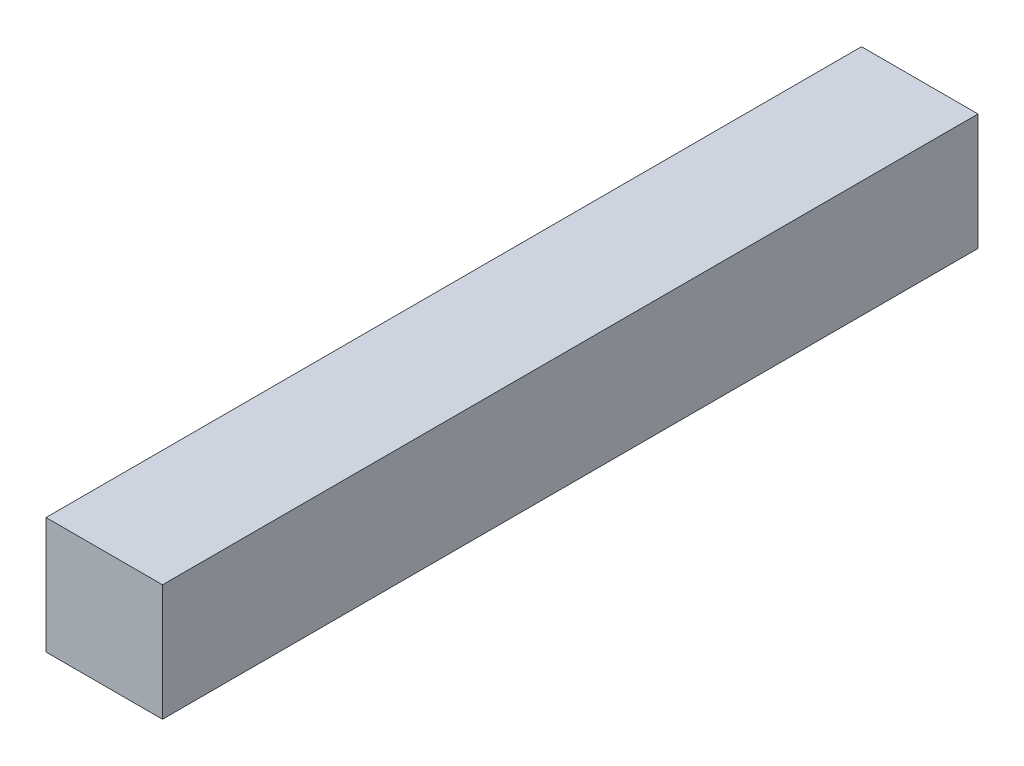
ISO-10303-21;
HEADER;
FILE_DESCRIPTION(('STEP AP214'),'2;1');
FILE_NAME('part.step','',(''),(''),'','','');
FILE_SCHEMA(('AUTOMOTIVE_DESIGN { 1 0 10303 214 1 1 1 1 }'));
ENDSEC;
DATA;
#1=APPLICATION_CONTEXT('core data for automotive mechanical design processes');
#2=APPLICATION_PROTOCOL_DEFINITION('international standard','automotive_design',2000,#1);
#3=PRODUCT_CONTEXT('',#1,'mechanical');
#4=PRODUCT('Part','Part','',(#3));
#5=PRODUCT_RELATED_PRODUCT_CATEGORY('part','',(#4));
#6=PRODUCT_DEFINITION_FORMATION('','',#4);
#7=PRODUCT_DEFINITION_CONTEXT('part definition',#1,'design');
#8=PRODUCT_DEFINITION('design','',#6,#7);
#9=PRODUCT_DEFINITION_SHAPE('','',#8);
#10=(LENGTH_UNIT() NAMED_UNIT(*) SI_UNIT(.MILLI.,.METRE.));
#11=(NAMED_UNIT(*) PLANE_ANGLE_UNIT() SI_UNIT($,.RADIAN.));
#12=(NAMED_UNIT(*) SI_UNIT($,.STERADIAN.) SOLID_ANGLE_UNIT());
#13=UNCERTAINTY_MEASURE_WITH_UNIT(LENGTH_MEASURE(1.E-05),#10,'distance_accuracy_value','');
#14=(GEOMETRIC_REPRESENTATION_CONTEXT(3) GLOBAL_UNCERTAINTY_ASSIGNED_CONTEXT((#13)) GLOBAL_UNIT_ASSIGNED_CONTEXT((#10,
#11,#12)) REPRESENTATION_CONTEXT('',''));
#15=CARTESIAN_POINT('',(0.,0.,0.));
#16=DIRECTION('',(0.,0.,1.));
#17=DIRECTION('',(1.,0.,0.));
#18=AXIS2_PLACEMENT_3D('',#15,#16,#17);
#19=CARTESIAN_POINT('',(-25.,-25.,350.));
#20=DIRECTION('',(1.,0.,0.));
#21=DIRECTION('',(0.,0.,-1.));
#22=AXIS2_PLACEMENT_3D('',#19,#20,#21);
#23=PLANE('',#22);
#24=DIRECTION('',(0.,-1.,0.));
#25=VECTOR('',#24,1.);
#26=CARTESIAN_POINT('',(-25.,-25.,0.));
#27=LINE('',#26,#25);
#28=CARTESIAN_POINT('',(-25.,25.,0.));
#29=VERTEX_POINT('',#28);
#30=CARTESIAN_POINT('',(-25.,-25.,0.));
#31=VERTEX_POINT('',#30);
#32=EDGE_CURVE('E111',#29,#31,#27,.T.);
#33=ORIENTED_EDGE('',*,*,#32,.T.);
#34=DIRECTION('',(0.,0.,-1.));
#35=VECTOR('',#34,1.);
#36=CARTESIAN_POINT('',(-25.,-25.,350.));
#37=LINE('',#36,#35);
#38=CARTESIAN_POINT('',(-25.,-25.,350.));
#39=VERTEX_POINT('',#38);
#40=EDGE_CURVE('E11',#39,#31,#37,.T.);
#41=ORIENTED_EDGE('',*,*,#40,.F.);
#42=DIRECTION('',(0.,-1.,0.));
#43=VECTOR('',#42,1.);
#44=CARTESIAN_POINT('',(-25.,-25.,350.));
#45=LINE('',#44,#43);
#46=CARTESIAN_POINT('',(-25.,25.,350.));
#47=VERTEX_POINT('',#46);
#48=EDGE_CURVE('E95',#47,#39,#45,.T.);
#49=ORIENTED_EDGE('',*,*,#48,.F.);
#50=DIRECTION('',(0.,0.,-1.));
#51=VECTOR('',#50,1.);
#52=CARTESIAN_POINT('',(-25.,25.,350.));
#53=LINE('',#52,#51);
#54=EDGE_CURVE('E107',#47,#29,#53,.T.);
#55=ORIENTED_EDGE('',*,*,#54,.T.);
#56=EDGE_LOOP('',(#33,#41,#49,#55));
#57=FACE_BOUND('',#56,.T.);
#58=ADVANCED_FACE('F43',(#57),#23,.F.);
#59=CARTESIAN_POINT('',(25.,-25.,350.));
#60=DIRECTION('',(0.,1.,0.));
#61=DIRECTION('',(-1.,0.,0.));
#62=AXIS2_PLACEMENT_3D('',#59,#60,#61);
#63=PLANE('',#62);
#64=DIRECTION('',(1.,0.,0.));
#65=VECTOR('',#64,1.);
#66=CARTESIAN_POINT('',(25.,-25.,0.));
#67=LINE('',#66,#65);
#68=CARTESIAN_POINT('',(25.,-25.,0.));
#69=VERTEX_POINT('',#68);
#70=EDGE_CURVE('E100',#31,#69,#67,.T.);
#71=ORIENTED_EDGE('',*,*,#70,.T.);
#72=DIRECTION('',(0.,0.,-1.));
#73=VECTOR('',#72,1.);
#74=CARTESIAN_POINT('',(25.,-25.,350.));
#75=LINE('',#74,#73);
#76=CARTESIAN_POINT('',(25.,-25.,350.));
#77=VERTEX_POINT('',#76);
#78=EDGE_CURVE('E52',#77,#69,#75,.T.);
#79=ORIENTED_EDGE('',*,*,#78,.F.);
#80=DIRECTION('',(1.,0.,0.));
#81=VECTOR('',#80,1.);
#82=CARTESIAN_POINT('',(25.,-25.,350.));
#83=LINE('',#82,#81);
#84=EDGE_CURVE('E90',#39,#77,#83,.T.);
#85=ORIENTED_EDGE('',*,*,#84,.F.);
#86=ORIENTED_EDGE('',*,*,#40,.T.);
#87=EDGE_LOOP('',(#71,#79,#85,#86));
#88=FACE_BOUND('',#87,.T.);
#89=ADVANCED_FACE('F99',(#88),#63,.F.);
#90=CARTESIAN_POINT('',(25.,-25.,350.));
#91=DIRECTION('',(-1.,0.,0.));
#92=DIRECTION('',(0.,0.,1.));
#93=AXIS2_PLACEMENT_3D('',#90,#91,#92);
#94=PLANE('',#93);
#95=DIRECTION('',(0.,1.,0.));
#96=VECTOR('',#95,1.);
#97=CARTESIAN_POINT('',(25.,-25.,0.));
#98=LINE('',#97,#96);
#99=CARTESIAN_POINT('',(25.,25.,0.));
#100=VERTEX_POINT('',#99);
#101=EDGE_CURVE('E77',#69,#100,#98,.T.);
#102=ORIENTED_EDGE('',*,*,#101,.T.);
#103=DIRECTION('',(0.,0.,-1.));
#104=VECTOR('',#103,1.);
#105=CARTESIAN_POINT('',(25.,25.,350.));
#106=LINE('',#105,#104);
#107=CARTESIAN_POINT('',(25.,25.,350.));
#108=VERTEX_POINT('',#107);
#109=EDGE_CURVE('E102',#108,#100,#106,.T.);
#110=ORIENTED_EDGE('',*,*,#109,.F.);
#111=DIRECTION('',(0.,1.,0.));
#112=VECTOR('',#111,1.);
#113=CARTESIAN_POINT('',(25.,-25.,350.));
#114=LINE('',#113,#112);
#115=EDGE_CURVE('E93',#77,#108,#114,.T.);
#116=ORIENTED_EDGE('',*,*,#115,.F.);
#117=ORIENTED_EDGE('',*,*,#78,.T.);
#118=EDGE_LOOP('',(#102,#110,#116,#117));
#119=FACE_BOUND('',#118,.T.);
#120=ADVANCED_FACE('F103',(#119),#94,.F.);
#121=CARTESIAN_POINT('',(25.,25.,350.));
#122=DIRECTION('',(0.,-1.,0.));
#123=DIRECTION('',(1.,0.,0.));
#124=AXIS2_PLACEMENT_3D('',#121,#122,#123);
#125=PLANE('',#124);
#126=DIRECTION('',(-1.,0.,0.));
#127=VECTOR('',#126,1.);
#128=CARTESIAN_POINT('',(25.,25.,0.));
#129=LINE('',#128,#127);
#130=EDGE_CURVE('E83',#100,#29,#129,.T.);
#131=ORIENTED_EDGE('',*,*,#130,.T.);
#132=ORIENTED_EDGE('',*,*,#54,.F.);
#133=DIRECTION('',(-1.,0.,0.));
#134=VECTOR('',#133,1.);
#135=CARTESIAN_POINT('',(25.,25.,350.));
#136=LINE('',#135,#134);
#137=EDGE_CURVE('E60',#108,#47,#136,.T.);
#138=ORIENTED_EDGE('',*,*,#137,.F.);
#139=ORIENTED_EDGE('',*,*,#109,.T.);
#140=EDGE_LOOP('',(#131,#132,#138,#139));
#141=FACE_BOUND('',#140,.T.);
#142=ADVANCED_FACE('F124',(#141),#125,.F.);
#143=CARTESIAN_POINT('',(0.,0.,350.));
#144=DIRECTION('',(0.,0.,1.));
#145=DIRECTION('',(1.,0.,0.));
#146=AXIS2_PLACEMENT_3D('',#143,#144,#145);
#147=PLANE('',#146);
#148=ORIENTED_EDGE('',*,*,#48,.T.);
#149=ORIENTED_EDGE('',*,*,#84,.T.);
#150=ORIENTED_EDGE('',*,*,#115,.T.);
#151=ORIENTED_EDGE('',*,*,#137,.T.);
#152=EDGE_LOOP('',(#148,#149,#150,#151));
#153=FACE_BOUND('',#152,.T.);
#154=ADVANCED_FACE('F91',(#153),#147,.T.);
#155=CARTESIAN_POINT('',(0.,0.,0.));
#156=DIRECTION('',(0.,0.,1.));
#157=DIRECTION('',(1.,0.,0.));
#158=AXIS2_PLACEMENT_3D('',#155,#156,#157);
#159=PLANE('',#158);
#160=ORIENTED_EDGE('',*,*,#32,.F.);
#161=ORIENTED_EDGE('',*,*,#130,.F.);
#162=ORIENTED_EDGE('',*,*,#101,.F.);
#163=ORIENTED_EDGE('',*,*,#70,.F.);
#164=EDGE_LOOP('',(#160,#161,#162,#163));
#165=FACE_BOUND('',#164,.T.);
#166=ADVANCED_FACE('F127',(#165),#159,.F.);
#167=CLOSED_SHELL('',(#58,#89,#120,#142,#154,#166));
#168=MANIFOLD_SOLID_BREP('B2',#167);
#169=ADVANCED_BREP_SHAPE_REPRESENTATION('',(#18,#168),#14);
#170=SHAPE_DEFINITION_REPRESENTATION(#9,#169);
ENDSEC;
END-ISO-10303-21;
